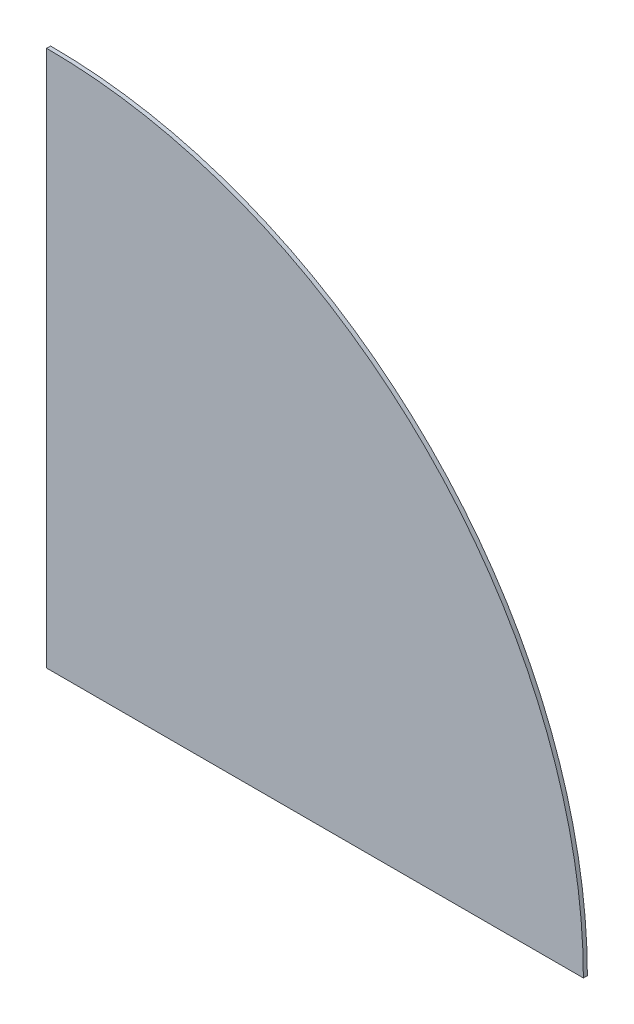
ISO-10303-21;
HEADER;
FILE_DESCRIPTION(('STEP AP214'),'2;1');
FILE_NAME('part.step','',(''),(''),'','','');
FILE_SCHEMA(('AUTOMOTIVE_DESIGN { 1 0 10303 214 1 1 1 1 }'));
ENDSEC;
DATA;
#1=APPLICATION_CONTEXT('core data for automotive mechanical design processes');
#2=APPLICATION_PROTOCOL_DEFINITION('international standard','automotive_design',2000,#1);
#3=PRODUCT_CONTEXT('',#1,'mechanical');
#4=PRODUCT('Part','Part','',(#3));
#5=PRODUCT_RELATED_PRODUCT_CATEGORY('part','',(#4));
#6=PRODUCT_DEFINITION_FORMATION('','',#4);
#7=PRODUCT_DEFINITION_CONTEXT('part definition',#1,'design');
#8=PRODUCT_DEFINITION('design','',#6,#7);
#9=PRODUCT_DEFINITION_SHAPE('','',#8);
#10=(LENGTH_UNIT() NAMED_UNIT(*) SI_UNIT(.MILLI.,.METRE.));
#11=(NAMED_UNIT(*) PLANE_ANGLE_UNIT() SI_UNIT($,.RADIAN.));
#12=(NAMED_UNIT(*) SI_UNIT($,.STERADIAN.) SOLID_ANGLE_UNIT());
#13=UNCERTAINTY_MEASURE_WITH_UNIT(LENGTH_MEASURE(1.E-05),#10,'distance_accuracy_value','');
#14=(GEOMETRIC_REPRESENTATION_CONTEXT(3) GLOBAL_UNCERTAINTY_ASSIGNED_CONTEXT((#13)) GLOBAL_UNIT_ASSIGNED_CONTEXT((#10,
#11,#12)) REPRESENTATION_CONTEXT('',''));
#15=CARTESIAN_POINT('',(0.,0.,0.));
#16=DIRECTION('',(0.,0.,1.));
#17=DIRECTION('',(1.,0.,0.));
#18=AXIS2_PLACEMENT_3D('',#15,#16,#17);
#19=CARTESIAN_POINT('',(-165.408360024912,-334.,1.));
#20=DIRECTION('',(-1.,0.,0.));
#21=DIRECTION('',(0.,0.,1.));
#22=AXIS2_PLACEMENT_3D('',#19,#20,#21);
#23=PLANE('',#22);
#24=DIRECTION('',(0.,1.,0.));
#25=VECTOR('',#24,1.);
#26=CARTESIAN_POINT('',(-165.408360024912,-334.,0.));
#27=LINE('',#26,#25);
#28=CARTESIAN_POINT('',(-165.408360024912,-334.,0.));
#29=VERTEX_POINT('',#28);
#30=CARTESIAN_POINT('',(-165.408360024912,-199.591639975088,0.));
#31=VERTEX_POINT('',#30);
#32=EDGE_CURVE('E90',#29,#31,#27,.T.);
#33=ORIENTED_EDGE('',*,*,#32,.F.);
#34=DIRECTION('',(0.,0.,-1.));
#35=VECTOR('',#34,1.);
#36=CARTESIAN_POINT('',(-165.408360024912,-334.,1.));
#37=LINE('',#36,#35);
#38=CARTESIAN_POINT('',(-165.408360024912,-334.,1.));
#39=VERTEX_POINT('',#38);
#40=EDGE_CURVE('E11',#39,#29,#37,.T.);
#41=ORIENTED_EDGE('',*,*,#40,.F.);
#42=DIRECTION('',(0.,1.,0.));
#43=VECTOR('',#42,1.);
#44=CARTESIAN_POINT('',(-165.408360024912,-334.,1.));
#45=LINE('',#44,#43);
#46=CARTESIAN_POINT('',(-165.408360024912,-199.591639975088,1.));
#47=VERTEX_POINT('',#46);
#48=EDGE_CURVE('E82',#39,#47,#45,.T.);
#49=ORIENTED_EDGE('',*,*,#48,.T.);
#50=DIRECTION('',(0.,0.,-1.));
#51=VECTOR('',#50,1.);
#52=CARTESIAN_POINT('',(-165.408360024912,-199.591639975088,1.));
#53=LINE('',#52,#51);
#54=EDGE_CURVE('E41',#47,#31,#53,.T.);
#55=ORIENTED_EDGE('',*,*,#54,.T.);
#56=EDGE_LOOP('',(#33,#41,#49,#55));
#57=FACE_BOUND('',#56,.T.);
#58=ADVANCED_FACE('F38',(#57),#23,.T.);
#59=CARTESIAN_POINT('',(-30.9999999999999,-334.,1.));
#60=DIRECTION('',(0.,-1.,0.));
#61=DIRECTION('',(0.,0.,-1.));
#62=AXIS2_PLACEMENT_3D('',#59,#60,#61);
#63=PLANE('',#62);
#64=DIRECTION('',(-1.,0.,0.));
#65=VECTOR('',#64,1.);
#66=CARTESIAN_POINT('',(-30.9999999999999,-334.,0.));
#67=LINE('',#66,#65);
#68=CARTESIAN_POINT('',(-30.9999999999999,-334.,0.));
#69=VERTEX_POINT('',#68);
#70=EDGE_CURVE('E84',#69,#29,#67,.T.);
#71=ORIENTED_EDGE('',*,*,#70,.F.);
#72=DIRECTION('',(0.,0.,-1.));
#73=VECTOR('',#72,1.);
#74=CARTESIAN_POINT('',(-30.9999999999999,-334.,1.));
#75=LINE('',#74,#73);
#76=CARTESIAN_POINT('',(-30.9999999999999,-334.,1.));
#77=VERTEX_POINT('',#76);
#78=EDGE_CURVE('E47',#77,#69,#75,.T.);
#79=ORIENTED_EDGE('',*,*,#78,.F.);
#80=DIRECTION('',(-1.,0.,0.));
#81=VECTOR('',#80,1.);
#82=CARTESIAN_POINT('',(-30.9999999999999,-334.,1.));
#83=LINE('',#82,#81);
#84=EDGE_CURVE('E79',#77,#39,#83,.T.);
#85=ORIENTED_EDGE('',*,*,#84,.T.);
#86=ORIENTED_EDGE('',*,*,#40,.T.);
#87=EDGE_LOOP('',(#71,#79,#85,#86));
#88=FACE_BOUND('',#87,.T.);
#89=ADVANCED_FACE('F94',(#88),#63,.T.);
#90=CARTESIAN_POINT('',(-165.408360024912,-334.,1.));
#91=DIRECTION('',(0.,0.,-1.));
#92=DIRECTION('',(-1.,0.,0.));
#93=AXIS2_PLACEMENT_3D('',#90,#91,#92);
#94=CYLINDRICAL_SURFACE('',#93,134.408360024912);
#95=CARTESIAN_POINT('',(-165.408360024912,-334.,0.));
#96=DIRECTION('',(0.,0.,-1.));
#97=DIRECTION('',(-1.,0.,0.));
#98=AXIS2_PLACEMENT_3D('',#95,#96,#97);
#99=CIRCLE('',#98,134.408360024912);
#100=EDGE_CURVE('E77',#31,#69,#99,.T.);
#101=ORIENTED_EDGE('',*,*,#100,.F.);
#102=ORIENTED_EDGE('',*,*,#54,.F.);
#103=CARTESIAN_POINT('',(-165.408360024912,-334.,1.));
#104=DIRECTION('',(0.,0.,-1.));
#105=DIRECTION('',(-1.,0.,0.));
#106=AXIS2_PLACEMENT_3D('',#103,#104,#105);
#107=CIRCLE('',#106,134.408360024912);
#108=EDGE_CURVE('E75',#47,#77,#107,.T.);
#109=ORIENTED_EDGE('',*,*,#108,.T.);
#110=ORIENTED_EDGE('',*,*,#78,.T.);
#111=EDGE_LOOP('',(#101,#102,#109,#110));
#112=FACE_BOUND('',#111,.T.);
#113=ADVANCED_FACE('F74',(#112),#94,.T.);
#114=CARTESIAN_POINT('',(-165.408360024912,-334.,1.));
#115=DIRECTION('',(0.,0.,-1.));
#116=DIRECTION('',(-1.,0.,0.));
#117=AXIS2_PLACEMENT_3D('',#114,#115,#116);
#118=PLANE('',#117);
#119=ORIENTED_EDGE('',*,*,#48,.F.);
#120=ORIENTED_EDGE('',*,*,#84,.F.);
#121=ORIENTED_EDGE('',*,*,#108,.F.);
#122=EDGE_LOOP('',(#119,#120,#121));
#123=FACE_BOUND('',#122,.T.);
#124=ADVANCED_FACE('F81',(#123),#118,.F.);
#125=CARTESIAN_POINT('',(-165.408360024912,-334.,0.));
#126=DIRECTION('',(0.,0.,-1.));
#127=DIRECTION('',(-1.,0.,0.));
#128=AXIS2_PLACEMENT_3D('',#125,#126,#127);
#129=PLANE('',#128);
#130=ORIENTED_EDGE('',*,*,#32,.T.);
#131=ORIENTED_EDGE('',*,*,#100,.T.);
#132=ORIENTED_EDGE('',*,*,#70,.T.);
#133=EDGE_LOOP('',(#130,#131,#132));
#134=FACE_BOUND('',#133,.T.);
#135=ADVANCED_FACE('F93',(#134),#129,.T.);
#136=CLOSED_SHELL('',(#58,#89,#113,#124,#135));
#137=MANIFOLD_SOLID_BREP('B2',#136);
#138=ADVANCED_BREP_SHAPE_REPRESENTATION('',(#18,#137),#14);
#139=SHAPE_DEFINITION_REPRESENTATION(#9,#138);
ENDSEC;
END-ISO-10303-21;
